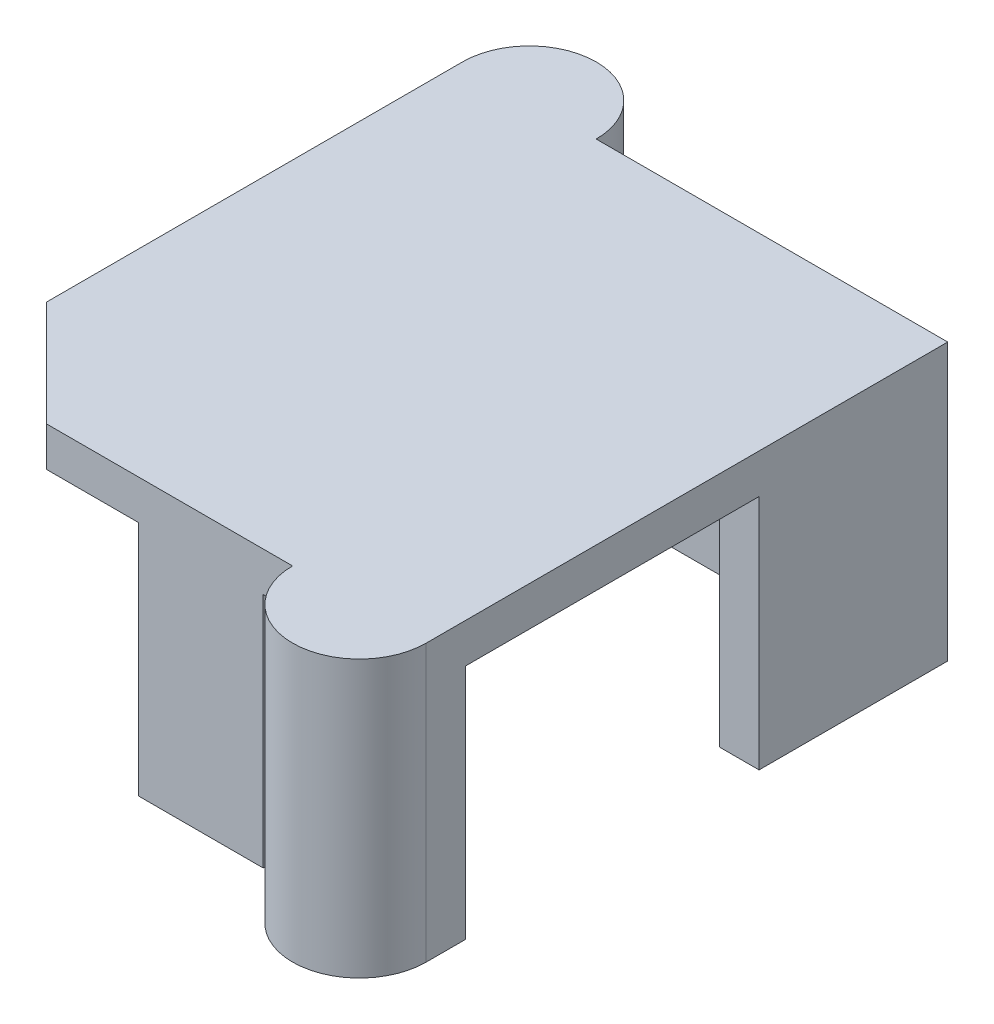
ISO-10303-21;
HEADER;
FILE_DESCRIPTION(('STEP AP214'),'2;1');
FILE_NAME('part.step','',(''),(''),'','','');
FILE_SCHEMA(('AUTOMOTIVE_DESIGN { 1 0 10303 214 1 1 1 1 }'));
ENDSEC;
DATA;
#1=APPLICATION_CONTEXT('core data for automotive mechanical design processes');
#2=APPLICATION_PROTOCOL_DEFINITION('international standard','automotive_design',2000,#1);
#3=PRODUCT_CONTEXT('',#1,'mechanical');
#4=PRODUCT('Part','Part','',(#3));
#5=PRODUCT_RELATED_PRODUCT_CATEGORY('part','',(#4));
#6=PRODUCT_DEFINITION_FORMATION('','',#4);
#7=PRODUCT_DEFINITION_CONTEXT('part definition',#1,'design');
#8=PRODUCT_DEFINITION('design','',#6,#7);
#9=PRODUCT_DEFINITION_SHAPE('','',#8);
#10=(LENGTH_UNIT() NAMED_UNIT(*) SI_UNIT(.MILLI.,.METRE.));
#11=(NAMED_UNIT(*) PLANE_ANGLE_UNIT() SI_UNIT($,.RADIAN.));
#12=(NAMED_UNIT(*) SI_UNIT($,.STERADIAN.) SOLID_ANGLE_UNIT());
#13=UNCERTAINTY_MEASURE_WITH_UNIT(LENGTH_MEASURE(1.E-05),#10,'distance_accuracy_value','');
#14=(GEOMETRIC_REPRESENTATION_CONTEXT(3) GLOBAL_UNCERTAINTY_ASSIGNED_CONTEXT((#13)) GLOBAL_UNIT_ASSIGNED_CONTEXT((#10,
#11,#12)) REPRESENTATION_CONTEXT('',''));
#15=CARTESIAN_POINT('',(0.,0.,0.));
#16=DIRECTION('',(0.,0.,1.));
#17=DIRECTION('',(1.,0.,0.));
#18=AXIS2_PLACEMENT_3D('',#15,#16,#17);
#19=CARTESIAN_POINT('',(0.,0.,0.));
#20=DIRECTION('',(0.,-1.,0.));
#21=DIRECTION('',(0.,0.,-1.));
#22=AXIS2_PLACEMENT_3D('',#19,#20,#21);
#23=PLANE('',#22);
#24=DIRECTION('',(0.,0.,-1.));
#25=VECTOR('',#24,1.);
#26=CARTESIAN_POINT('',(3.02,0.,9.91));
#27=LINE('',#26,#25);
#28=CARTESIAN_POINT('',(3.02,0.,9.91));
#29=VERTEX_POINT('',#28);
#30=CARTESIAN_POINT('',(3.02,0.,8.41));
#31=VERTEX_POINT('',#30);
#32=EDGE_CURVE('E271',#29,#31,#27,.T.);
#33=ORIENTED_EDGE('',*,*,#32,.F.);
#34=DIRECTION('',(1.,0.,0.));
#35=VECTOR('',#34,1.);
#36=CARTESIAN_POINT('',(0.,0.,9.91));
#37=LINE('',#36,#35);
#38=CARTESIAN_POINT('',(-1.72,0.,9.91));
#39=VERTEX_POINT('',#38);
#40=EDGE_CURVE('E424',#39,#29,#37,.T.);
#41=ORIENTED_EDGE('',*,*,#40,.F.);
#42=DIRECTION('',(0.,0.,1.));
#43=VECTOR('',#42,1.);
#44=CARTESIAN_POINT('',(-1.72,0.,9.91));
#45=LINE('',#44,#43);
#46=CARTESIAN_POINT('',(-1.72,0.,8.41));
#47=VERTEX_POINT('',#46);
#48=EDGE_CURVE('E332',#47,#39,#45,.T.);
#49=ORIENTED_EDGE('',*,*,#48,.F.);
#50=DIRECTION('',(1.,0.,0.));
#51=VECTOR('',#50,1.);
#52=CARTESIAN_POINT('',(-7.72,0.,8.41));
#53=LINE('',#52,#51);
#54=EDGE_CURVE('E375',#47,#31,#53,.T.);
#55=ORIENTED_EDGE('',*,*,#54,.T.);
#56=EDGE_LOOP('',(#33,#41,#49,#55));
#57=FACE_BOUND('',#56,.T.);
#58=ADVANCED_FACE('F41',(#57),#23,.T.);
#59=CARTESIAN_POINT('',(-6.68,0.,-10.63));
#60=DIRECTION('',(0.,-1.,0.));
#61=DIRECTION('',(0.,0.,-1.));
#62=AXIS2_PLACEMENT_3D('',#59,#60,#61);
#63=CIRCLE('',#62,0.575);
#64=CARTESIAN_POINT('',(-6.68,0.,-11.205));
#65=VERTEX_POINT('',#64);
#66=EDGE_CURVE('E227',#65,#65,#63,.T.);
#67=ORIENTED_EDGE('',*,*,#66,.F.);
#68=EDGE_LOOP('',(#67));
#69=FACE_BOUND('',#68,.T.);
#70=DIRECTION('',(0.,0.,-1.));
#71=VECTOR('',#70,1.);
#72=CARTESIAN_POINT('',(3.02,0.,-9.91));
#73=LINE('',#72,#71);
#74=CARTESIAN_POINT('',(3.02,0.,-8.41));
#75=VERTEX_POINT('',#74);
#76=CARTESIAN_POINT('',(3.02,0.,-9.91));
#77=VERTEX_POINT('',#76);
#78=EDGE_CURVE('E301',#75,#77,#73,.T.);
#79=ORIENTED_EDGE('',*,*,#78,.F.);
#80=DIRECTION('',(-1.,0.,0.));
#81=VECTOR('',#80,1.);
#82=CARTESIAN_POINT('',(-7.72,0.,-8.41));
#83=LINE('',#82,#81);
#84=CARTESIAN_POINT('',(-7.72,0.,-8.41));
#85=VERTEX_POINT('',#84);
#86=EDGE_CURVE('E392',#75,#85,#83,.T.);
#87=ORIENTED_EDGE('',*,*,#86,.T.);
#88=DIRECTION('',(0.,0.,1.));
#89=VECTOR('',#88,1.);
#90=CARTESIAN_POINT('',(-7.72,0.,8.41));
#91=LINE('',#90,#89);
#92=CARTESIAN_POINT('',(-7.72,0.,1.41));
#93=VERTEX_POINT('',#92);
#94=EDGE_CURVE('E397',#85,#93,#91,.T.);
#95=ORIENTED_EDGE('',*,*,#94,.T.);
#96=DIRECTION('',(1.,0.,0.));
#97=VECTOR('',#96,1.);
#98=CARTESIAN_POINT('',(-9.22,0.,1.41));
#99=LINE('',#98,#97);
#100=CARTESIAN_POINT('',(-9.22,0.,1.41));
#101=VERTEX_POINT('',#100);
#102=EDGE_CURVE('E270',#101,#93,#99,.T.);
#103=ORIENTED_EDGE('',*,*,#102,.F.);
#104=DIRECTION('',(0.,0.,1.));
#105=VECTOR('',#104,1.);
#106=CARTESIAN_POINT('',(-9.22,0.,0.));
#107=LINE('',#106,#105);
#108=CARTESIAN_POINT('',(-9.22,0.,-9.91));
#109=VERTEX_POINT('',#108);
#110=EDGE_CURVE('E448',#109,#101,#107,.T.);
#111=ORIENTED_EDGE('',*,*,#110,.F.);
#112=CARTESIAN_POINT('',(-6.68,0.,-9.91));
#113=DIRECTION('',(0.,-1.,0.));
#114=DIRECTION('',(0.,0.,-1.));
#115=AXIS2_PLACEMENT_3D('',#112,#113,#114);
#116=CIRCLE('',#115,2.54);
#117=CARTESIAN_POINT('',(-4.14,0.,-9.91));
#118=VERTEX_POINT('',#117);
#119=EDGE_CURVE('E238',#109,#118,#116,.T.);
#120=ORIENTED_EDGE('',*,*,#119,.T.);
#121=DIRECTION('',(-1.,0.,0.));
#122=VECTOR('',#121,1.);
#123=CARTESIAN_POINT('',(0.,0.,-9.91));
#124=LINE('',#123,#122);
#125=EDGE_CURVE('E444',#77,#118,#124,.T.);
#126=ORIENTED_EDGE('',*,*,#125,.F.);
#127=EDGE_LOOP('',(#79,#87,#95,#103,#111,#120,#126));
#128=FACE_BOUND('',#127,.T.);
#129=ADVANCED_FACE('F473',(#69,#128),#23,.T.);
#130=CARTESIAN_POINT('',(-7.72,9.,-8.41));
#131=DIRECTION('',(0.,0.,1.));
#132=DIRECTION('',(1.,0.,0.));
#133=AXIS2_PLACEMENT_3D('',#130,#131,#132);
#134=PLANE('',#133);
#135=DIRECTION('',(0.,-1.,0.));
#136=VECTOR('',#135,1.);
#137=CARTESIAN_POINT('',(3.02,10.8720042734994,-8.41));
#138=LINE('',#137,#136);
#139=CARTESIAN_POINT('',(3.02,9.,-8.41));
#140=VERTEX_POINT('',#139);
#141=EDGE_CURVE('E308',#140,#75,#138,.T.);
#142=ORIENTED_EDGE('',*,*,#141,.F.);
#143=DIRECTION('',(-1.,0.,0.));
#144=VECTOR('',#143,1.);
#145=CARTESIAN_POINT('',(-7.72,9.,-8.41));
#146=LINE('',#145,#144);
#147=CARTESIAN_POINT('',(-7.72,9.,-8.41));
#148=VERTEX_POINT('',#147);
#149=EDGE_CURVE('E374',#140,#148,#146,.T.);
#150=ORIENTED_EDGE('',*,*,#149,.T.);
#151=DIRECTION('',(0.,-1.,0.));
#152=VECTOR('',#151,1.);
#153=CARTESIAN_POINT('',(-7.72,9.,-8.41));
#154=LINE('',#153,#152);
#155=EDGE_CURVE('E389',#148,#85,#154,.T.);
#156=ORIENTED_EDGE('',*,*,#155,.T.);
#157=ORIENTED_EDGE('',*,*,#86,.F.);
#158=EDGE_LOOP('',(#142,#150,#156,#157));
#159=FACE_BOUND('',#158,.T.);
#160=ADVANCED_FACE('F483',(#159),#134,.T.);
#161=CARTESIAN_POINT('',(-7.72,9.,8.41));
#162=DIRECTION('',(0.,0.,-1.));
#163=DIRECTION('',(-1.,0.,0.));
#164=AXIS2_PLACEMENT_3D('',#161,#162,#163);
#165=PLANE('',#164);
#166=DIRECTION('',(0.,-1.,0.));
#167=VECTOR('',#166,1.);
#168=CARTESIAN_POINT('',(3.02,10.8720042734994,8.41));
#169=LINE('',#168,#167);
#170=CARTESIAN_POINT('',(3.02,9.,8.41));
#171=VERTEX_POINT('',#170);
#172=EDGE_CURVE('E278',#171,#31,#169,.T.);
#173=ORIENTED_EDGE('',*,*,#172,.T.);
#174=ORIENTED_EDGE('',*,*,#54,.F.);
#175=DIRECTION('',(0.,-1.,0.));
#176=VECTOR('',#175,1.);
#177=CARTESIAN_POINT('',(-1.72,9.,8.41));
#178=LINE('',#177,#176);
#179=CARTESIAN_POINT('',(-1.72,9.,8.41));
#180=VERTEX_POINT('',#179);
#181=EDGE_CURVE('E346',#180,#47,#178,.T.);
#182=ORIENTED_EDGE('',*,*,#181,.F.);
#183=DIRECTION('',(1.,0.,0.));
#184=VECTOR('',#183,1.);
#185=CARTESIAN_POINT('',(-7.72,9.,8.41));
#186=LINE('',#185,#184);
#187=EDGE_CURVE('E385',#180,#171,#186,.T.);
#188=ORIENTED_EDGE('',*,*,#187,.T.);
#189=EDGE_LOOP('',(#173,#174,#182,#188));
#190=FACE_BOUND('',#189,.T.);
#191=ADVANCED_FACE('F542',(#190),#165,.T.);
#192=CARTESIAN_POINT('',(6.68,0.,10.63));
#193=DIRECTION('',(0.,-1.,0.));
#194=DIRECTION('',(0.,0.,-1.));
#195=AXIS2_PLACEMENT_3D('',#192,#193,#194);
#196=CIRCLE('',#195,0.575);
#197=CARTESIAN_POINT('',(6.68,0.,10.055));
#198=VERTEX_POINT('',#197);
#199=EDGE_CURVE('E218',#198,#198,#196,.T.);
#200=ORIENTED_EDGE('',*,*,#199,.F.);
#201=EDGE_LOOP('',(#200));
#202=FACE_BOUND('',#201,.T.);
#203=DIRECTION('',(0.,0.,1.));
#204=VECTOR('',#203,1.);
#205=CARTESIAN_POINT('',(4.14,0.,9.91));
#206=LINE('',#205,#204);
#207=CARTESIAN_POINT('',(4.14,0.,8.41));
#208=VERTEX_POINT('',#207);
#209=CARTESIAN_POINT('',(4.14,0.,9.91));
#210=VERTEX_POINT('',#209);
#211=EDGE_CURVE('E274',#208,#210,#206,.T.);
#212=ORIENTED_EDGE('',*,*,#211,.F.);
#213=CARTESIAN_POINT('',(9.22,0.,8.41));
#214=VERTEX_POINT('',#213);
#215=EDGE_CURVE('E401',#208,#214,#53,.T.);
#216=ORIENTED_EDGE('',*,*,#215,.T.);
#217=DIRECTION('',(0.,0.,-1.));
#218=VECTOR('',#217,1.);
#219=CARTESIAN_POINT('',(9.22,0.,0.));
#220=LINE('',#219,#218);
#221=CARTESIAN_POINT('',(9.22,0.,9.91));
#222=VERTEX_POINT('',#221);
#223=EDGE_CURVE('E440',#222,#214,#220,.T.);
#224=ORIENTED_EDGE('',*,*,#223,.F.);
#225=CARTESIAN_POINT('',(6.68,0.,9.91));
#226=DIRECTION('',(0.,-1.,0.));
#227=DIRECTION('',(0.,0.,1.));
#228=AXIS2_PLACEMENT_3D('',#225,#226,#227);
#229=CIRCLE('',#228,2.54);
#230=EDGE_CURVE('E243',#222,#210,#229,.T.);
#231=ORIENTED_EDGE('',*,*,#230,.T.);
#232=EDGE_LOOP('',(#212,#216,#224,#231));
#233=FACE_BOUND('',#232,.T.);
#234=ADVANCED_FACE('F530',(#202,#233),#23,.T.);
#235=DIRECTION('',(0.,0.,1.));
#236=VECTOR('',#235,1.);
#237=CARTESIAN_POINT('',(4.14,0.,-9.91));
#238=LINE('',#237,#236);
#239=CARTESIAN_POINT('',(4.14,0.,-9.91));
#240=VERTEX_POINT('',#239);
#241=CARTESIAN_POINT('',(4.14,0.,-8.41));
#242=VERTEX_POINT('',#241);
#243=EDGE_CURVE('E254',#240,#242,#238,.T.);
#244=ORIENTED_EDGE('',*,*,#243,.F.);
#245=CARTESIAN_POINT('',(9.22,0.,-9.91));
#246=VERTEX_POINT('',#245);
#247=EDGE_CURVE('E452',#246,#240,#124,.T.);
#248=ORIENTED_EDGE('',*,*,#247,.F.);
#249=CARTESIAN_POINT('',(9.22,0.,-2.74));
#250=VERTEX_POINT('',#249);
#251=EDGE_CURVE('E412',#250,#246,#220,.T.);
#252=ORIENTED_EDGE('',*,*,#251,.F.);
#253=DIRECTION('',(1.,0.,0.));
#254=VECTOR('',#253,1.);
#255=CARTESIAN_POINT('',(9.22,0.,-2.74));
#256=LINE('',#255,#254);
#257=CARTESIAN_POINT('',(7.72,0.,-2.74));
#258=VERTEX_POINT('',#257);
#259=EDGE_CURVE('E349',#258,#250,#256,.T.);
#260=ORIENTED_EDGE('',*,*,#259,.F.);
#261=DIRECTION('',(0.,0.,-1.));
#262=VECTOR('',#261,1.);
#263=CARTESIAN_POINT('',(7.72,0.,8.41));
#264=LINE('',#263,#262);
#265=CARTESIAN_POINT('',(7.72,0.,-8.41));
#266=VERTEX_POINT('',#265);
#267=EDGE_CURVE('E358',#258,#266,#264,.T.);
#268=ORIENTED_EDGE('',*,*,#267,.T.);
#269=EDGE_CURVE('E393',#266,#242,#83,.T.);
#270=ORIENTED_EDGE('',*,*,#269,.T.);
#271=EDGE_LOOP('',(#244,#248,#252,#260,#268,#270));
#272=FACE_BOUND('',#271,.T.);
#273=ADVANCED_FACE('F525',(#272),#23,.T.);
#274=CARTESIAN_POINT('',(9.22,9.,8.41));
#275=DIRECTION('',(-1.,0.,0.));
#276=DIRECTION('',(0.,0.,1.));
#277=AXIS2_PLACEMENT_3D('',#274,#275,#276);
#278=PLANE('',#277);
#279=DIRECTION('',(0.,0.,-1.));
#280=VECTOR('',#279,1.);
#281=CARTESIAN_POINT('',(9.22,9.,8.41));
#282=LINE('',#281,#280);
#283=CARTESIAN_POINT('',(9.22,9.,8.41));
#284=VERTEX_POINT('',#283);
#285=CARTESIAN_POINT('',(9.22,9.,-2.74));
#286=VERTEX_POINT('',#285);
#287=EDGE_CURVE('E353',#284,#286,#282,.T.);
#288=ORIENTED_EDGE('',*,*,#287,.T.);
#289=DIRECTION('',(0.,-1.,0.));
#290=VECTOR('',#289,1.);
#291=CARTESIAN_POINT('',(9.22,20.2504444356656,-2.74));
#292=LINE('',#291,#290);
#293=EDGE_CURVE('E354',#286,#250,#292,.T.);
#294=ORIENTED_EDGE('',*,*,#293,.T.);
#295=ORIENTED_EDGE('',*,*,#251,.T.);
#296=DIRECTION('',(0.,-1.,0.));
#297=VECTOR('',#296,1.);
#298=CARTESIAN_POINT('',(9.22,9.,-9.91));
#299=LINE('',#298,#297);
#300=CARTESIAN_POINT('',(9.22,10.5,-9.91));
#301=VERTEX_POINT('',#300);
#302=EDGE_CURVE('E413',#301,#246,#299,.T.);
#303=ORIENTED_EDGE('',*,*,#302,.F.);
#304=DIRECTION('',(0.,0.,-1.));
#305=VECTOR('',#304,1.);
#306=CARTESIAN_POINT('',(9.22,10.5,0.));
#307=LINE('',#306,#305);
#308=CARTESIAN_POINT('',(9.22,10.5,9.91));
#309=VERTEX_POINT('',#308);
#310=EDGE_CURVE('E419',#309,#301,#307,.T.);
#311=ORIENTED_EDGE('',*,*,#310,.F.);
#312=DIRECTION('',(0.,-1.,0.));
#313=VECTOR('',#312,1.);
#314=CARTESIAN_POINT('',(9.22,9.,9.91));
#315=LINE('',#314,#313);
#316=EDGE_CURVE('E425',#309,#222,#315,.T.);
#317=ORIENTED_EDGE('',*,*,#316,.T.);
#318=ORIENTED_EDGE('',*,*,#223,.T.);
#319=DIRECTION('',(0.,-1.,0.));
#320=VECTOR('',#319,1.);
#321=CARTESIAN_POINT('',(9.22,20.2504444356656,8.41));
#322=LINE('',#321,#320);
#323=EDGE_CURVE('E361',#284,#214,#322,.T.);
#324=ORIENTED_EDGE('',*,*,#323,.F.);
#325=EDGE_LOOP('',(#288,#294,#295,#303,#311,#317,#318,#324));
#326=FACE_BOUND('',#325,.T.);
#327=ADVANCED_FACE('F535',(#326),#278,.F.);
#328=CARTESIAN_POINT('',(-7.72,9.,-9.91));
#329=DIRECTION('',(0.,0.,1.));
#330=DIRECTION('',(1.,0.,0.));
#331=AXIS2_PLACEMENT_3D('',#328,#329,#330);
#332=PLANE('',#331);
#333=ORIENTED_EDGE('',*,*,#125,.T.);
#334=DIRECTION('',(0.,-1.,0.));
#335=VECTOR('',#334,1.);
#336=CARTESIAN_POINT('',(-4.14,16.1796126628495,-9.91));
#337=LINE('',#336,#335);
#338=CARTESIAN_POINT('',(-4.14,10.5,-9.91));
#339=VERTEX_POINT('',#338);
#340=EDGE_CURVE('E244',#339,#118,#337,.T.);
#341=ORIENTED_EDGE('',*,*,#340,.F.);
#342=DIRECTION('',(-1.,0.,0.));
#343=VECTOR('',#342,1.);
#344=CARTESIAN_POINT('',(0.,10.5,-9.91));
#345=LINE('',#344,#343);
#346=EDGE_CURVE('E423',#301,#339,#345,.T.);
#347=ORIENTED_EDGE('',*,*,#346,.F.);
#348=ORIENTED_EDGE('',*,*,#302,.T.);
#349=ORIENTED_EDGE('',*,*,#247,.T.);
#350=DIRECTION('',(0.,-1.,0.));
#351=VECTOR('',#350,1.);
#352=CARTESIAN_POINT('',(4.14,10.8720042734994,-9.91));
#353=LINE('',#352,#351);
#354=CARTESIAN_POINT('',(4.14,9.,-9.91));
#355=VERTEX_POINT('',#354);
#356=EDGE_CURVE('E304',#355,#240,#353,.T.);
#357=ORIENTED_EDGE('',*,*,#356,.F.);
#358=DIRECTION('',(-1.,0.,0.));
#359=VECTOR('',#358,1.);
#360=CARTESIAN_POINT('',(3.02,9.,-9.91));
#361=LINE('',#360,#359);
#362=CARTESIAN_POINT('',(3.02,9.,-9.91));
#363=VERTEX_POINT('',#362);
#364=EDGE_CURVE('E294',#355,#363,#361,.T.);
#365=ORIENTED_EDGE('',*,*,#364,.T.);
#366=DIRECTION('',(0.,-1.,0.));
#367=VECTOR('',#366,1.);
#368=CARTESIAN_POINT('',(3.02,10.8720042734994,-9.91));
#369=LINE('',#368,#367);
#370=EDGE_CURVE('E295',#363,#77,#369,.T.);
#371=ORIENTED_EDGE('',*,*,#370,.T.);
#372=EDGE_LOOP('',(#333,#341,#347,#348,#349,#357,#365,#371));
#373=FACE_BOUND('',#372,.T.);
#374=ADVANCED_FACE('F505',(#373),#332,.F.);
#375=CARTESIAN_POINT('',(-9.22,9.,8.41));
#376=DIRECTION('',(1.,0.,0.));
#377=DIRECTION('',(0.,0.,-1.));
#378=AXIS2_PLACEMENT_3D('',#375,#376,#377);
#379=PLANE('',#378);
#380=DIRECTION('',(0.,0.,1.));
#381=VECTOR('',#380,1.);
#382=CARTESIAN_POINT('',(-9.22,9.,9.91));
#383=LINE('',#382,#381);
#384=CARTESIAN_POINT('',(-9.22,9.,1.41));
#385=VERTEX_POINT('',#384);
#386=CARTESIAN_POINT('',(-9.22,9.,5.90999999999999));
#387=VERTEX_POINT('',#386);
#388=EDGE_CURVE('E326',#385,#387,#383,.T.);
#389=ORIENTED_EDGE('',*,*,#388,.T.);
#390=DIRECTION('',(0.,1.,0.));
#391=VECTOR('',#390,1.);
#392=CARTESIAN_POINT('',(-9.22,9.,5.90999999999999));
#393=LINE('',#392,#391);
#394=CARTESIAN_POINT('',(-9.22,10.5,5.90999999999999));
#395=VERTEX_POINT('',#394);
#396=EDGE_CURVE('E51',#387,#395,#393,.T.);
#397=ORIENTED_EDGE('',*,*,#396,.T.);
#398=DIRECTION('',(0.,0.,1.));
#399=VECTOR('',#398,1.);
#400=CARTESIAN_POINT('',(-9.22,10.5,0.));
#401=LINE('',#400,#399);
#402=CARTESIAN_POINT('',(-9.22,10.5,-9.91));
#403=VERTEX_POINT('',#402);
#404=EDGE_CURVE('E435',#403,#395,#401,.T.);
#405=ORIENTED_EDGE('',*,*,#404,.F.);
#406=DIRECTION('',(0.,-1.,0.));
#407=VECTOR('',#406,1.);
#408=CARTESIAN_POINT('',(-9.22,9.,-9.91));
#409=LINE('',#408,#407);
#410=EDGE_CURVE('E418',#403,#109,#409,.T.);
#411=ORIENTED_EDGE('',*,*,#410,.T.);
#412=ORIENTED_EDGE('',*,*,#110,.T.);
#413=DIRECTION('',(0.,-1.,0.));
#414=VECTOR('',#413,1.);
#415=CARTESIAN_POINT('',(-9.22,20.3357840487546,1.41));
#416=LINE('',#415,#414);
#417=EDGE_CURVE('E335',#385,#101,#416,.T.);
#418=ORIENTED_EDGE('',*,*,#417,.F.);
#419=EDGE_LOOP('',(#389,#397,#405,#411,#412,#418));
#420=FACE_BOUND('',#419,.T.);
#421=ADVANCED_FACE('F496',(#420),#379,.F.);
#422=CARTESIAN_POINT('',(-7.72,9.,9.91));
#423=DIRECTION('',(0.,0.,-1.));
#424=DIRECTION('',(-1.,0.,0.));
#425=AXIS2_PLACEMENT_3D('',#422,#423,#424);
#426=PLANE('',#425);
#427=DIRECTION('',(1.,0.,0.));
#428=VECTOR('',#427,1.);
#429=CARTESIAN_POINT('',(3.02,9.,9.91));
#430=LINE('',#429,#428);
#431=CARTESIAN_POINT('',(3.02,9.,9.91));
#432=VERTEX_POINT('',#431);
#433=CARTESIAN_POINT('',(4.14,9.,9.91));
#434=VERTEX_POINT('',#433);
#435=EDGE_CURVE('E263',#432,#434,#430,.T.);
#436=ORIENTED_EDGE('',*,*,#435,.T.);
#437=DIRECTION('',(0.,-1.,0.));
#438=VECTOR('',#437,1.);
#439=CARTESIAN_POINT('',(4.14,16.1796126628495,9.91));
#440=LINE('',#439,#438);
#441=CARTESIAN_POINT('',(4.14,10.5,9.91));
#442=VERTEX_POINT('',#441);
#443=EDGE_CURVE('E58',#442,#434,#440,.T.);
#444=ORIENTED_EDGE('',*,*,#443,.F.);
#445=DIRECTION('',(1.,0.,0.));
#446=VECTOR('',#445,1.);
#447=CARTESIAN_POINT('',(0.,10.5,9.91));
#448=LINE('',#447,#446);
#449=CARTESIAN_POINT('',(-5.21999999999999,10.5,9.91));
#450=VERTEX_POINT('',#449);
#451=EDGE_CURVE('E428',#450,#442,#448,.T.);
#452=ORIENTED_EDGE('',*,*,#451,.F.);
#453=DIRECTION('',(0.,-1.,0.));
#454=VECTOR('',#453,1.);
#455=CARTESIAN_POINT('',(-5.21999999999999,9.,9.91));
#456=LINE('',#455,#454);
#457=CARTESIAN_POINT('',(-5.21999999999999,9.,9.91));
#458=VERTEX_POINT('',#457);
#459=EDGE_CURVE('E417',#450,#458,#456,.T.);
#460=ORIENTED_EDGE('',*,*,#459,.T.);
#461=DIRECTION('',(1.,0.,0.));
#462=VECTOR('',#461,1.);
#463=CARTESIAN_POINT('',(-9.22,9.,9.91));
#464=LINE('',#463,#462);
#465=CARTESIAN_POINT('',(-1.72,9.,9.91));
#466=VERTEX_POINT('',#465);
#467=EDGE_CURVE('E322',#458,#466,#464,.T.);
#468=ORIENTED_EDGE('',*,*,#467,.T.);
#469=DIRECTION('',(0.,-1.,0.));
#470=VECTOR('',#469,1.);
#471=CARTESIAN_POINT('',(-1.72,20.3357840487546,9.91));
#472=LINE('',#471,#470);
#473=EDGE_CURVE('E323',#466,#39,#472,.T.);
#474=ORIENTED_EDGE('',*,*,#473,.T.);
#475=ORIENTED_EDGE('',*,*,#40,.T.);
#476=DIRECTION('',(0.,-1.,0.));
#477=VECTOR('',#476,1.);
#478=CARTESIAN_POINT('',(3.02,10.8720042734994,9.91));
#479=LINE('',#478,#477);
#480=EDGE_CURVE('E264',#432,#29,#479,.T.);
#481=ORIENTED_EDGE('',*,*,#480,.F.);
#482=EDGE_LOOP('',(#436,#444,#452,#460,#468,#474,#475,#481));
#483=FACE_BOUND('',#482,.T.);
#484=ADVANCED_FACE('F582',(#483),#426,.F.);
#485=CARTESIAN_POINT('',(0.,10.5,0.));
#486=DIRECTION('',(0.,-1.,0.));
#487=DIRECTION('',(0.,0.,-1.));
#488=AXIS2_PLACEMENT_3D('',#485,#486,#487);
#489=PLANE('',#488);
#490=ORIENTED_EDGE('',*,*,#404,.T.);
#491=DIRECTION('',(-0.707106781186548,0.,-0.707106781186548));
#492=VECTOR('',#491,1.);
#493=CARTESIAN_POINT('',(-5.21999999999999,10.5,9.91));
#494=LINE('',#493,#492);
#495=EDGE_CURVE('E11',#395,#450,#494,.F.);
#496=ORIENTED_EDGE('',*,*,#495,.T.);
#497=ORIENTED_EDGE('',*,*,#451,.T.);
#498=CARTESIAN_POINT('',(6.68,10.5,9.91));
#499=DIRECTION('',(0.,-1.,0.));
#500=DIRECTION('',(0.,0.,-1.));
#501=AXIS2_PLACEMENT_3D('',#498,#499,#500);
#502=CIRCLE('',#501,2.54);
#503=EDGE_CURVE('E250',#442,#309,#502,.F.);
#504=ORIENTED_EDGE('',*,*,#503,.T.);
#505=ORIENTED_EDGE('',*,*,#310,.T.);
#506=ORIENTED_EDGE('',*,*,#346,.T.);
#507=CARTESIAN_POINT('',(-6.68,10.5,-9.91));
#508=DIRECTION('',(0.,-1.,0.));
#509=DIRECTION('',(0.,0.,-1.));
#510=AXIS2_PLACEMENT_3D('',#507,#508,#509);
#511=CIRCLE('',#510,2.54);
#512=EDGE_CURVE('E239',#339,#403,#511,.F.);
#513=ORIENTED_EDGE('',*,*,#512,.T.);
#514=EDGE_LOOP('',(#490,#496,#497,#504,#505,#506,#513));
#515=FACE_BOUND('',#514,.T.);
#516=ADVANCED_FACE('F501',(#515),#489,.F.);
#517=CARTESIAN_POINT('',(7.72,9.,8.41));
#518=DIRECTION('',(-1.,0.,0.));
#519=DIRECTION('',(0.,0.,1.));
#520=AXIS2_PLACEMENT_3D('',#517,#518,#519);
#521=PLANE('',#520);
#522=DIRECTION('',(0.,-1.,0.));
#523=VECTOR('',#522,1.);
#524=CARTESIAN_POINT('',(7.72,20.2504444356656,-2.74));
#525=LINE('',#524,#523);
#526=CARTESIAN_POINT('',(7.72,9.,-2.74));
#527=VERTEX_POINT('',#526);
#528=EDGE_CURVE('E365',#527,#258,#525,.T.);
#529=ORIENTED_EDGE('',*,*,#528,.F.);
#530=DIRECTION('',(0.,0.,-1.));
#531=VECTOR('',#530,1.);
#532=CARTESIAN_POINT('',(7.72,9.,8.41));
#533=LINE('',#532,#531);
#534=CARTESIAN_POINT('',(7.72,9.,-8.41));
#535=VERTEX_POINT('',#534);
#536=EDGE_CURVE('E371',#527,#535,#533,.T.);
#537=ORIENTED_EDGE('',*,*,#536,.T.);
#538=DIRECTION('',(0.,-1.,0.));
#539=VECTOR('',#538,1.);
#540=CARTESIAN_POINT('',(7.72,9.,-8.41));
#541=LINE('',#540,#539);
#542=EDGE_CURVE('E408',#535,#266,#541,.T.);
#543=ORIENTED_EDGE('',*,*,#542,.T.);
#544=ORIENTED_EDGE('',*,*,#267,.F.);
#545=EDGE_LOOP('',(#529,#537,#543,#544));
#546=FACE_BOUND('',#545,.T.);
#547=ADVANCED_FACE('F557',(#546),#521,.T.);
#548=DIRECTION('',(0.,-1.,0.));
#549=VECTOR('',#548,1.);
#550=CARTESIAN_POINT('',(4.14,10.8720042734994,-8.41));
#551=LINE('',#550,#549);
#552=CARTESIAN_POINT('',(4.14,9.,-8.41));
#553=VERTEX_POINT('',#552);
#554=EDGE_CURVE('E311',#553,#242,#551,.T.);
#555=ORIENTED_EDGE('',*,*,#554,.T.);
#556=ORIENTED_EDGE('',*,*,#269,.F.);
#557=ORIENTED_EDGE('',*,*,#542,.F.);
#558=EDGE_CURVE('E376',#535,#553,#146,.T.);
#559=ORIENTED_EDGE('',*,*,#558,.T.);
#560=EDGE_LOOP('',(#555,#556,#557,#559));
#561=FACE_BOUND('',#560,.T.);
#562=ADVANCED_FACE('F553',(#561),#134,.T.);
#563=CARTESIAN_POINT('',(-7.72,9.,8.41));
#564=DIRECTION('',(1.,0.,0.));
#565=DIRECTION('',(0.,0.,-1.));
#566=AXIS2_PLACEMENT_3D('',#563,#564,#565);
#567=PLANE('',#566);
#568=DIRECTION('',(0.,1.,0.));
#569=VECTOR('',#568,1.);
#570=CARTESIAN_POINT('',(-7.72,9.,1.41));
#571=LINE('',#570,#569);
#572=CARTESIAN_POINT('',(-7.72,9.,1.41));
#573=VERTEX_POINT('',#572);
#574=EDGE_CURVE('E343',#93,#573,#571,.T.);
#575=ORIENTED_EDGE('',*,*,#574,.F.);
#576=ORIENTED_EDGE('',*,*,#94,.F.);
#577=ORIENTED_EDGE('',*,*,#155,.F.);
#578=DIRECTION('',(0.,0.,1.));
#579=VECTOR('',#578,1.);
#580=CARTESIAN_POINT('',(-7.72,9.,8.41));
#581=LINE('',#580,#579);
#582=EDGE_CURVE('E380',#148,#573,#581,.T.);
#583=ORIENTED_EDGE('',*,*,#582,.T.);
#584=EDGE_LOOP('',(#575,#576,#577,#583));
#585=FACE_BOUND('',#584,.T.);
#586=ADVANCED_FACE('F481',(#585),#567,.T.);
#587=DIRECTION('',(0.,-1.,0.));
#588=VECTOR('',#587,1.);
#589=CARTESIAN_POINT('',(4.14,10.8720042734994,8.41));
#590=LINE('',#589,#588);
#591=CARTESIAN_POINT('',(4.14,9.,8.41));
#592=VERTEX_POINT('',#591);
#593=EDGE_CURVE('E285',#592,#208,#590,.T.);
#594=ORIENTED_EDGE('',*,*,#593,.F.);
#595=EDGE_CURVE('E384',#592,#284,#186,.T.);
#596=ORIENTED_EDGE('',*,*,#595,.T.);
#597=ORIENTED_EDGE('',*,*,#323,.T.);
#598=ORIENTED_EDGE('',*,*,#215,.F.);
#599=EDGE_LOOP('',(#594,#596,#597,#598));
#600=FACE_BOUND('',#599,.T.);
#601=ADVANCED_FACE('F569',(#600),#165,.T.);
#602=CARTESIAN_POINT('',(0.,9.,0.));
#603=DIRECTION('',(0.,-1.,0.));
#604=DIRECTION('',(0.,0.,-1.));
#605=AXIS2_PLACEMENT_3D('',#602,#603,#604);
#606=PLANE('',#605);
#607=ORIENTED_EDGE('',*,*,#467,.F.);
#608=DIRECTION('',(0.707106781186548,0.,0.707106781186548));
#609=VECTOR('',#608,1.);
#610=CARTESIAN_POINT('',(-7.56499999999999,9.,7.56499999999999));
#611=LINE('',#610,#609);
#612=EDGE_CURVE('E459',#458,#387,#611,.F.);
#613=ORIENTED_EDGE('',*,*,#612,.T.);
#614=ORIENTED_EDGE('',*,*,#388,.F.);
#615=DIRECTION('',(-1.,0.,0.));
#616=VECTOR('',#615,1.);
#617=CARTESIAN_POINT('',(-9.22,9.,1.41));
#618=LINE('',#617,#616);
#619=EDGE_CURVE('E329',#573,#385,#618,.T.);
#620=ORIENTED_EDGE('',*,*,#619,.F.);
#621=ORIENTED_EDGE('',*,*,#582,.F.);
#622=ORIENTED_EDGE('',*,*,#149,.F.);
#623=DIRECTION('',(0.,0.,1.));
#624=VECTOR('',#623,1.);
#625=CARTESIAN_POINT('',(3.02,9.,-9.91));
#626=LINE('',#625,#624);
#627=EDGE_CURVE('E291',#363,#140,#626,.T.);
#628=ORIENTED_EDGE('',*,*,#627,.F.);
#629=ORIENTED_EDGE('',*,*,#364,.F.);
#630=DIRECTION('',(0.,0.,-1.));
#631=VECTOR('',#630,1.);
#632=CARTESIAN_POINT('',(4.14,9.,-9.91));
#633=LINE('',#632,#631);
#634=EDGE_CURVE('E275',#553,#355,#633,.T.);
#635=ORIENTED_EDGE('',*,*,#634,.F.);
#636=ORIENTED_EDGE('',*,*,#558,.F.);
#637=ORIENTED_EDGE('',*,*,#536,.F.);
#638=DIRECTION('',(-1.,0.,0.));
#639=VECTOR('',#638,1.);
#640=CARTESIAN_POINT('',(9.22,9.,-2.74));
#641=LINE('',#640,#639);
#642=EDGE_CURVE('E350',#286,#527,#641,.T.);
#643=ORIENTED_EDGE('',*,*,#642,.F.);
#644=ORIENTED_EDGE('',*,*,#287,.F.);
#645=ORIENTED_EDGE('',*,*,#595,.F.);
#646=DIRECTION('',(0.,0.,-1.));
#647=VECTOR('',#646,1.);
#648=CARTESIAN_POINT('',(4.14,9.,9.91));
#649=LINE('',#648,#647);
#650=EDGE_CURVE('E260',#434,#592,#649,.T.);
#651=ORIENTED_EDGE('',*,*,#650,.F.);
#652=ORIENTED_EDGE('',*,*,#435,.F.);
#653=DIRECTION('',(0.,0.,1.));
#654=VECTOR('',#653,1.);
#655=CARTESIAN_POINT('',(3.02,9.,9.91));
#656=LINE('',#655,#654);
#657=EDGE_CURVE('E267',#171,#432,#656,.T.);
#658=ORIENTED_EDGE('',*,*,#657,.F.);
#659=ORIENTED_EDGE('',*,*,#187,.F.);
#660=DIRECTION('',(0.,0.,-1.));
#661=VECTOR('',#660,1.);
#662=CARTESIAN_POINT('',(-1.72,9.,9.91));
#663=LINE('',#662,#661);
#664=EDGE_CURVE('E319',#466,#180,#663,.T.);
#665=ORIENTED_EDGE('',*,*,#664,.F.);
#666=EDGE_LOOP('',(#607,#613,#614,#620,#621,#622,#628,#629,#635,#636,#637,#643,#644,#645,#651,
#652,#658,#659,#665));
#667=FACE_BOUND('',#666,.T.);
#668=ADVANCED_FACE('F487',(#667),#606,.T.);
#669=CARTESIAN_POINT('',(9.22,20.2504444356656,-2.74));
#670=DIRECTION('',(0.,0.,-1.));
#671=DIRECTION('',(-1.,0.,0.));
#672=AXIS2_PLACEMENT_3D('',#669,#670,#671);
#673=PLANE('',#672);
#674=ORIENTED_EDGE('',*,*,#642,.T.);
#675=ORIENTED_EDGE('',*,*,#528,.T.);
#676=ORIENTED_EDGE('',*,*,#259,.T.);
#677=ORIENTED_EDGE('',*,*,#293,.F.);
#678=EDGE_LOOP('',(#674,#675,#676,#677));
#679=FACE_BOUND('',#678,.T.);
#680=ADVANCED_FACE('F560',(#679),#673,.F.);
#681=CARTESIAN_POINT('',(-1.72,20.3357840487546,9.91));
#682=DIRECTION('',(1.,0.,0.));
#683=DIRECTION('',(0.,0.,-1.));
#684=AXIS2_PLACEMENT_3D('',#681,#682,#683);
#685=PLANE('',#684);
#686=ORIENTED_EDGE('',*,*,#181,.T.);
#687=ORIENTED_EDGE('',*,*,#48,.T.);
#688=ORIENTED_EDGE('',*,*,#473,.F.);
#689=ORIENTED_EDGE('',*,*,#664,.T.);
#690=EDGE_LOOP('',(#686,#687,#688,#689));
#691=FACE_BOUND('',#690,.T.);
#692=ADVANCED_FACE('F519',(#691),#685,.F.);
#693=CARTESIAN_POINT('',(-9.22,20.3357840487546,1.41));
#694=DIRECTION('',(0.,0.,-1.));
#695=DIRECTION('',(-1.,0.,0.));
#696=AXIS2_PLACEMENT_3D('',#693,#694,#695);
#697=PLANE('',#696);
#698=ORIENTED_EDGE('',*,*,#574,.T.);
#699=ORIENTED_EDGE('',*,*,#619,.T.);
#700=ORIENTED_EDGE('',*,*,#417,.T.);
#701=ORIENTED_EDGE('',*,*,#102,.T.);
#702=EDGE_LOOP('',(#698,#699,#700,#701));
#703=FACE_BOUND('',#702,.T.);
#704=ADVANCED_FACE('F494',(#703),#697,.F.);
#705=CARTESIAN_POINT('',(3.02,10.8720042734994,-9.91));
#706=DIRECTION('',(-1.,0.,0.));
#707=DIRECTION('',(0.,0.,1.));
#708=AXIS2_PLACEMENT_3D('',#705,#706,#707);
#709=PLANE('',#708);
#710=ORIENTED_EDGE('',*,*,#627,.T.);
#711=ORIENTED_EDGE('',*,*,#141,.T.);
#712=ORIENTED_EDGE('',*,*,#78,.T.);
#713=ORIENTED_EDGE('',*,*,#370,.F.);
#714=EDGE_LOOP('',(#710,#711,#712,#713));
#715=FACE_BOUND('',#714,.T.);
#716=ADVANCED_FACE('F508',(#715),#709,.F.);
#717=CARTESIAN_POINT('',(4.14,10.8720042734994,-9.91));
#718=DIRECTION('',(1.,0.,0.));
#719=DIRECTION('',(0.,0.,-1.));
#720=AXIS2_PLACEMENT_3D('',#717,#718,#719);
#721=PLANE('',#720);
#722=ORIENTED_EDGE('',*,*,#634,.T.);
#723=ORIENTED_EDGE('',*,*,#356,.T.);
#724=ORIENTED_EDGE('',*,*,#243,.T.);
#725=ORIENTED_EDGE('',*,*,#554,.F.);
#726=EDGE_LOOP('',(#722,#723,#724,#725));
#727=FACE_BOUND('',#726,.T.);
#728=ADVANCED_FACE('F510',(#727),#721,.F.);
#729=CARTESIAN_POINT('',(3.02,10.8720042734994,9.91));
#730=DIRECTION('',(-1.,0.,0.));
#731=DIRECTION('',(0.,0.,1.));
#732=AXIS2_PLACEMENT_3D('',#729,#730,#731);
#733=PLANE('',#732);
#734=ORIENTED_EDGE('',*,*,#657,.T.);
#735=ORIENTED_EDGE('',*,*,#480,.T.);
#736=ORIENTED_EDGE('',*,*,#32,.T.);
#737=ORIENTED_EDGE('',*,*,#172,.F.);
#738=EDGE_LOOP('',(#734,#735,#736,#737));
#739=FACE_BOUND('',#738,.T.);
#740=ADVANCED_FACE('F516',(#739),#733,.F.);
#741=CARTESIAN_POINT('',(4.14,10.8720042734994,9.91));
#742=DIRECTION('',(1.,0.,0.));
#743=DIRECTION('',(0.,0.,-1.));
#744=AXIS2_PLACEMENT_3D('',#741,#742,#743);
#745=PLANE('',#744);
#746=ORIENTED_EDGE('',*,*,#650,.T.);
#747=ORIENTED_EDGE('',*,*,#593,.T.);
#748=ORIENTED_EDGE('',*,*,#211,.T.);
#749=DIRECTION('',(0.,-1.,0.));
#750=VECTOR('',#749,1.);
#751=CARTESIAN_POINT('',(4.14,10.8720042734994,9.91));
#752=LINE('',#751,#750);
#753=EDGE_CURVE('E281',#434,#210,#752,.T.);
#754=ORIENTED_EDGE('',*,*,#753,.F.);
#755=EDGE_LOOP('',(#746,#747,#748,#754));
#756=FACE_BOUND('',#755,.T.);
#757=ADVANCED_FACE('F573',(#756),#745,.F.);
#758=CARTESIAN_POINT('',(-5.21999999999999,9.,9.91));
#759=DIRECTION('',(0.707106781186548,0.,-0.707106781186548));
#760=DIRECTION('',(0.,-1.,0.));
#761=AXIS2_PLACEMENT_3D('',#758,#759,#760);
#762=PLANE('',#761);
#763=ORIENTED_EDGE('',*,*,#495,.F.);
#764=ORIENTED_EDGE('',*,*,#396,.F.);
#765=ORIENTED_EDGE('',*,*,#612,.F.);
#766=ORIENTED_EDGE('',*,*,#459,.F.);
#767=EDGE_LOOP('',(#763,#764,#765,#766));
#768=FACE_BOUND('',#767,.T.);
#769=ADVANCED_FACE('F44',(#768),#762,.F.);
#770=CARTESIAN_POINT('',(6.68,16.1796126628495,9.91));
#771=DIRECTION('',(0.,-1.,0.));
#772=DIRECTION('',(0.,0.,-1.));
#773=AXIS2_PLACEMENT_3D('',#770,#771,#772);
#774=CYLINDRICAL_SURFACE('',#773,2.54);
#775=ORIENTED_EDGE('',*,*,#503,.F.);
#776=ORIENTED_EDGE('',*,*,#443,.T.);
#777=ORIENTED_EDGE('',*,*,#753,.T.);
#778=ORIENTED_EDGE('',*,*,#230,.F.);
#779=ORIENTED_EDGE('',*,*,#316,.F.);
#780=EDGE_LOOP('',(#775,#776,#777,#778,#779));
#781=FACE_BOUND('',#780,.T.);
#782=ADVANCED_FACE('F580',(#781),#774,.T.);
#783=CARTESIAN_POINT('',(-6.68,16.1796126628495,-9.91));
#784=DIRECTION('',(0.,-1.,0.));
#785=DIRECTION('',(0.,0.,-1.));
#786=AXIS2_PLACEMENT_3D('',#783,#784,#785);
#787=CYLINDRICAL_SURFACE('',#786,2.54);
#788=ORIENTED_EDGE('',*,*,#512,.F.);
#789=ORIENTED_EDGE('',*,*,#340,.T.);
#790=ORIENTED_EDGE('',*,*,#119,.F.);
#791=ORIENTED_EDGE('',*,*,#410,.F.);
#792=EDGE_LOOP('',(#788,#789,#790,#791));
#793=FACE_BOUND('',#792,.T.);
#794=ADVANCED_FACE('F498',(#793),#787,.T.);
#795=CARTESIAN_POINT('',(6.68,7.66952665953484,10.63));
#796=DIRECTION('',(0.,-1.,0.));
#797=DIRECTION('',(0.,0.,-1.));
#798=AXIS2_PLACEMENT_3D('',#795,#796,#797);
#799=CONICAL_SURFACE('',#798,0.549999999999998,1.02974425867665);
#800=CARTESIAN_POINT('',(6.68,8.,10.63));
#801=VERTEX_POINT('',#800);
#802=VERTEX_LOOP('',#801);
#803=FACE_BOUND('',#802,.T.);
#804=CARTESIAN_POINT('',(6.68,7.66952665953484,10.63));
#805=DIRECTION('',(0.,-1.,0.));
#806=DIRECTION('',(0.,0.,-1.));
#807=AXIS2_PLACEMENT_3D('',#804,#805,#806);
#808=CIRCLE('',#807,0.549999999999998);
#809=CARTESIAN_POINT('',(6.68,7.66952665953484,10.08));
#810=VERTEX_POINT('',#809);
#811=EDGE_CURVE('E234',#810,#810,#808,.T.);
#812=ORIENTED_EDGE('',*,*,#811,.T.);
#813=EDGE_LOOP('',(#812));
#814=FACE_BOUND('',#813,.T.);
#815=ADVANCED_FACE('F609',(#803,#814),#799,.F.);
#816=CARTESIAN_POINT('',(6.68,0.,10.63));
#817=DIRECTION('',(0.,-1.,0.));
#818=DIRECTION('',(0.,0.,-1.));
#819=AXIS2_PLACEMENT_3D('',#816,#817,#818);
#820=CYLINDRICAL_SURFACE('',#819,0.549999999999999);
#821=ORIENTED_EDGE('',*,*,#811,.F.);
#822=EDGE_LOOP('',(#821));
#823=FACE_BOUND('',#822,.T.);
#824=CARTESIAN_POINT('',(6.68,0.0250000000000007,10.63));
#825=DIRECTION('',(0.,-1.,0.));
#826=DIRECTION('',(0.,0.,-1.));
#827=AXIS2_PLACEMENT_3D('',#824,#825,#826);
#828=CIRCLE('',#827,0.549999999999999);
#829=CARTESIAN_POINT('',(6.68,0.0250000000000007,10.08));
#830=VERTEX_POINT('',#829);
#831=EDGE_CURVE('E224',#830,#830,#828,.T.);
#832=ORIENTED_EDGE('',*,*,#831,.T.);
#833=EDGE_LOOP('',(#832));
#834=FACE_BOUND('',#833,.T.);
#835=ADVANCED_FACE('F612',(#823,#834),#820,.F.);
#836=CARTESIAN_POINT('',(6.68,0.,10.63));
#837=DIRECTION('',(0.,-1.,0.));
#838=DIRECTION('',(0.,0.,-1.));
#839=AXIS2_PLACEMENT_3D('',#836,#837,#838);
#840=CONICAL_SURFACE('',#839,0.575,0.785398163397448);
#841=ORIENTED_EDGE('',*,*,#831,.F.);
#842=EDGE_LOOP('',(#841));
#843=FACE_BOUND('',#842,.T.);
#844=ORIENTED_EDGE('',*,*,#199,.T.);
#845=EDGE_LOOP('',(#844));
#846=FACE_BOUND('',#845,.T.);
#847=ADVANCED_FACE('F211',(#843,#846),#840,.F.);
#848=CARTESIAN_POINT('',(-6.68,7.66952665953484,-10.63));
#849=DIRECTION('',(0.,-1.,0.));
#850=DIRECTION('',(0.,0.,-1.));
#851=AXIS2_PLACEMENT_3D('',#848,#849,#850);
#852=CONICAL_SURFACE('',#851,0.549999999999998,1.02974425867665);
#853=CARTESIAN_POINT('',(-6.68,8.,-10.63));
#854=VERTEX_POINT('',#853);
#855=VERTEX_LOOP('',#854);
#856=FACE_BOUND('',#855,.T.);
#857=CARTESIAN_POINT('',(-6.68,7.66952665953484,-10.63));
#858=DIRECTION('',(0.,-1.,0.));
#859=DIRECTION('',(0.,0.,-1.));
#860=AXIS2_PLACEMENT_3D('',#857,#858,#859);
#861=CIRCLE('',#860,0.549999999999998);
#862=CARTESIAN_POINT('',(-6.68,7.66952665953484,-11.18));
#863=VERTEX_POINT('',#862);
#864=EDGE_CURVE('E215',#863,#863,#861,.T.);
#865=ORIENTED_EDGE('',*,*,#864,.T.);
#866=EDGE_LOOP('',(#865));
#867=FACE_BOUND('',#866,.T.);
#868=ADVANCED_FACE('F207',(#856,#867),#852,.F.);
#869=CARTESIAN_POINT('',(-6.68,0.,-10.63));
#870=DIRECTION('',(0.,-1.,0.));
#871=DIRECTION('',(0.,0.,-1.));
#872=AXIS2_PLACEMENT_3D('',#869,#870,#871);
#873=CYLINDRICAL_SURFACE('',#872,0.549999999999999);
#874=ORIENTED_EDGE('',*,*,#864,.F.);
#875=EDGE_LOOP('',(#874));
#876=FACE_BOUND('',#875,.T.);
#877=CARTESIAN_POINT('',(-6.68,0.0250000000000007,-10.63));
#878=DIRECTION('',(0.,-1.,0.));
#879=DIRECTION('',(0.,0.,-1.));
#880=AXIS2_PLACEMENT_3D('',#877,#878,#879);
#881=CIRCLE('',#880,0.549999999999999);
#882=CARTESIAN_POINT('',(-6.68,0.0250000000000007,-11.18));
#883=VERTEX_POINT('',#882);
#884=EDGE_CURVE('E219',#883,#883,#881,.T.);
#885=ORIENTED_EDGE('',*,*,#884,.T.);
#886=EDGE_LOOP('',(#885));
#887=FACE_BOUND('',#886,.T.);
#888=ADVANCED_FACE('F210',(#876,#887),#873,.F.);
#889=CARTESIAN_POINT('',(-6.68,0.,-10.63));
#890=DIRECTION('',(0.,-1.,0.));
#891=DIRECTION('',(0.,0.,-1.));
#892=AXIS2_PLACEMENT_3D('',#889,#890,#891);
#893=CONICAL_SURFACE('',#892,0.575,0.785398163397448);
#894=ORIENTED_EDGE('',*,*,#884,.F.);
#895=EDGE_LOOP('',(#894));
#896=FACE_BOUND('',#895,.T.);
#897=ORIENTED_EDGE('',*,*,#66,.T.);
#898=EDGE_LOOP('',(#897));
#899=FACE_BOUND('',#898,.T.);
#900=ADVANCED_FACE('F622',(#896,#899),#893,.F.);
#901=CLOSED_SHELL('',(#58,#129,#160,#191,#234,#273,#327,#374,#421,#484,#516,#547,#562,#586,#601,
#668,#680,#692,#704,#716,#728,#740,#757,#769,#782,#794,#815,#835,#847,#868,#888,#900));
#902=MANIFOLD_SOLID_BREP('B2',#901);
#903=ADVANCED_BREP_SHAPE_REPRESENTATION('',(#18,#902),#14);
#904=SHAPE_DEFINITION_REPRESENTATION(#9,#903);
ENDSEC;
END-ISO-10303-21;
